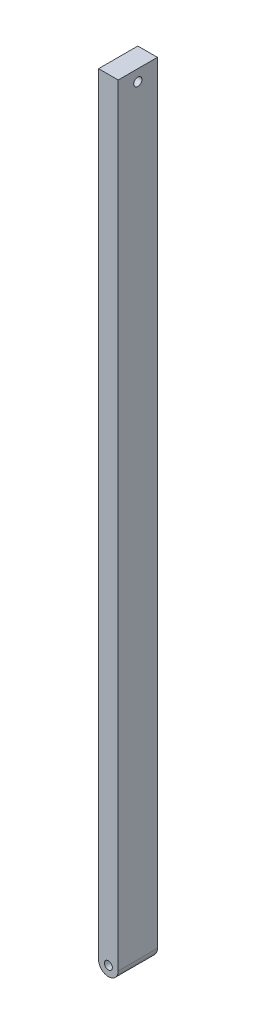
ISO-10303-21;
HEADER;
FILE_DESCRIPTION(('STEP AP214'),'2;1');
FILE_NAME('part.step','',(''),(''),'','','');
FILE_SCHEMA(('AUTOMOTIVE_DESIGN { 1 0 10303 214 1 1 1 1 }'));
ENDSEC;
DATA;
#1=APPLICATION_CONTEXT('core data for automotive mechanical design processes');
#2=APPLICATION_PROTOCOL_DEFINITION('international standard','automotive_design',2000,#1);
#3=PRODUCT_CONTEXT('',#1,'mechanical');
#4=PRODUCT('Part','Part','',(#3));
#5=PRODUCT_RELATED_PRODUCT_CATEGORY('part','',(#4));
#6=PRODUCT_DEFINITION_FORMATION('','',#4);
#7=PRODUCT_DEFINITION_CONTEXT('part definition',#1,'design');
#8=PRODUCT_DEFINITION('design','',#6,#7);
#9=PRODUCT_DEFINITION_SHAPE('','',#8);
#10=(LENGTH_UNIT() NAMED_UNIT(*) SI_UNIT(.MILLI.,.METRE.));
#11=(NAMED_UNIT(*) PLANE_ANGLE_UNIT() SI_UNIT($,.RADIAN.));
#12=(NAMED_UNIT(*) SI_UNIT($,.STERADIAN.) SOLID_ANGLE_UNIT());
#13=UNCERTAINTY_MEASURE_WITH_UNIT(LENGTH_MEASURE(1.E-05),#10,'distance_accuracy_value','');
#14=(GEOMETRIC_REPRESENTATION_CONTEXT(3) GLOBAL_UNCERTAINTY_ASSIGNED_CONTEXT((#13)) GLOBAL_UNIT_ASSIGNED_CONTEXT((#10,
#11,#12)) REPRESENTATION_CONTEXT('',''));
#15=CARTESIAN_POINT('',(0.,0.,0.));
#16=DIRECTION('',(0.,0.,1.));
#17=DIRECTION('',(1.,0.,0.));
#18=AXIS2_PLACEMENT_3D('',#15,#16,#17);
#19=CARTESIAN_POINT('',(-0.499999999999996,-40.8979953044151,2.));
#20=DIRECTION('',(0.,0.,1.));
#21=DIRECTION('',(1.,0.,0.));
#22=AXIS2_PLACEMENT_3D('',#19,#20,#21);
#23=PLANE('',#22);
#24=DIRECTION('',(0.,-1.,0.));
#25=VECTOR('',#24,1.);
#26=CARTESIAN_POINT('',(-1.,-2.1479953044151,2.));
#27=LINE('',#26,#25);
#28=CARTESIAN_POINT('',(-1.,-1.5679953044151,2.));
#29=VERTEX_POINT('',#28);
#30=CARTESIAN_POINT('',(-0.999999999999996,-40.8979953044151,2.));
#31=VERTEX_POINT('',#30);
#32=EDGE_CURVE('E77',#29,#31,#27,.T.);
#33=ORIENTED_EDGE('',*,*,#32,.T.);
#34=CARTESIAN_POINT('',(-0.499999999999996,-40.8979953044151,2.));
#35=DIRECTION('',(0.,0.,1.));
#36=DIRECTION('',(1.,0.,0.));
#37=AXIS2_PLACEMENT_3D('',#34,#35,#36);
#38=CIRCLE('',#37,0.5);
#39=CARTESIAN_POINT('',(0.,-40.8979953044151,2.));
#40=VERTEX_POINT('',#39);
#41=EDGE_CURVE('E80',#31,#40,#38,.T.);
#42=ORIENTED_EDGE('',*,*,#41,.T.);
#43=DIRECTION('',(0.,1.,0.));
#44=VECTOR('',#43,1.);
#45=CARTESIAN_POINT('',(0.,-2.1479953044151,2.));
#46=LINE('',#45,#44);
#47=CARTESIAN_POINT('',(0.,-1.5679953044151,2.));
#48=VERTEX_POINT('',#47);
#49=EDGE_CURVE('E84',#40,#48,#46,.T.);
#50=ORIENTED_EDGE('',*,*,#49,.T.);
#51=DIRECTION('',(-1.,0.,0.));
#52=VECTOR('',#51,1.);
#53=CARTESIAN_POINT('',(-1.,-1.5679953044151,2.));
#54=LINE('',#53,#52);
#55=EDGE_CURVE('E49',#48,#29,#54,.T.);
#56=ORIENTED_EDGE('',*,*,#55,.T.);
#57=EDGE_LOOP('',(#33,#42,#50,#56));
#58=FACE_BOUND('',#57,.T.);
#59=CARTESIAN_POINT('',(-0.499999999999996,-40.8979953044151,2.));
#60=DIRECTION('',(0.,0.,1.));
#61=DIRECTION('',(1.,0.,0.));
#62=AXIS2_PLACEMENT_3D('',#59,#60,#61);
#63=CIRCLE('',#62,0.20387092882995);
#64=CARTESIAN_POINT('',(-0.296129071170045,-40.8979953044151,2.));
#65=VERTEX_POINT('',#64);
#66=EDGE_CURVE('E98',#65,#65,#63,.T.);
#67=ORIENTED_EDGE('',*,*,#66,.F.);
#68=EDGE_LOOP('',(#67));
#69=FACE_BOUND('',#68,.T.);
#70=ADVANCED_FACE('F32',(#58,#69),#23,.T.);
#71=CARTESIAN_POINT('',(-0.499999999999996,-40.8979953044151,0.));
#72=DIRECTION('',(0.,0.,1.));
#73=DIRECTION('',(1.,0.,0.));
#74=AXIS2_PLACEMENT_3D('',#71,#72,#73);
#75=PLANE('',#74);
#76=DIRECTION('',(0.,-1.,0.));
#77=VECTOR('',#76,1.);
#78=CARTESIAN_POINT('',(-1.,-2.1479953044151,0.));
#79=LINE('',#78,#77);
#80=CARTESIAN_POINT('',(-1.,-1.5679953044151,0.));
#81=VERTEX_POINT('',#80);
#82=CARTESIAN_POINT('',(-0.999999999999996,-40.8979953044151,0.));
#83=VERTEX_POINT('',#82);
#84=EDGE_CURVE('E72',#81,#83,#79,.T.);
#85=ORIENTED_EDGE('',*,*,#84,.F.);
#86=DIRECTION('',(-1.,0.,0.));
#87=VECTOR('',#86,1.);
#88=CARTESIAN_POINT('',(-1.,-1.5679953044151,0.));
#89=LINE('',#88,#87);
#90=CARTESIAN_POINT('',(0.,-1.5679953044151,0.));
#91=VERTEX_POINT('',#90);
#92=EDGE_CURVE('E101',#91,#81,#89,.T.);
#93=ORIENTED_EDGE('',*,*,#92,.F.);
#94=DIRECTION('',(0.,1.,0.));
#95=VECTOR('',#94,1.);
#96=CARTESIAN_POINT('',(0.,-1.5679953044151,0.));
#97=LINE('',#96,#95);
#98=CARTESIAN_POINT('',(0.,-40.8979953044151,0.));
#99=VERTEX_POINT('',#98);
#100=EDGE_CURVE('E65',#99,#91,#97,.T.);
#101=ORIENTED_EDGE('',*,*,#100,.F.);
#102=CARTESIAN_POINT('',(-0.499999999999996,-40.8979953044151,0.));
#103=DIRECTION('',(0.,0.,1.));
#104=DIRECTION('',(1.,0.,0.));
#105=AXIS2_PLACEMENT_3D('',#102,#103,#104);
#106=CIRCLE('',#105,0.5);
#107=EDGE_CURVE('E89',#83,#99,#106,.T.);
#108=ORIENTED_EDGE('',*,*,#107,.F.);
#109=EDGE_LOOP('',(#85,#93,#101,#108));
#110=FACE_BOUND('',#109,.T.);
#111=CARTESIAN_POINT('',(-0.499999999999996,-40.8979953044151,0.));
#112=DIRECTION('',(0.,0.,1.));
#113=DIRECTION('',(1.,0.,0.));
#114=AXIS2_PLACEMENT_3D('',#111,#112,#113);
#115=CIRCLE('',#114,0.20387092882995);
#116=CARTESIAN_POINT('',(-0.296129071170045,-40.8979953044151,0.));
#117=VERTEX_POINT('',#116);
#118=EDGE_CURVE('E113',#117,#117,#115,.T.);
#119=ORIENTED_EDGE('',*,*,#118,.T.);
#120=EDGE_LOOP('',(#119));
#121=FACE_BOUND('',#120,.T.);
#122=ADVANCED_FACE('F107',(#110,#121),#75,.F.);
#123=CARTESIAN_POINT('',(-1.,-2.1479953044151,2.));
#124=DIRECTION('',(1.,0.,0.));
#125=DIRECTION('',(0.,1.,0.));
#126=AXIS2_PLACEMENT_3D('',#123,#124,#125);
#127=PLANE('',#126);
#128=CARTESIAN_POINT('',(-1.00000000000008,-2.1479953044151,1.));
#129=DIRECTION('',(1.,0.,0.));
#130=DIRECTION('',(0.,1.,0.));
#131=AXIS2_PLACEMENT_3D('',#128,#129,#130);
#132=CIRCLE('',#131,0.208826812329482);
#133=CARTESIAN_POINT('',(-1.00000000000008,-1.93916849208562,1.));
#134=VERTEX_POINT('',#133);
#135=EDGE_CURVE('E115',#134,#134,#132,.T.);
#136=ORIENTED_EDGE('',*,*,#135,.T.);
#137=EDGE_LOOP('',(#136));
#138=FACE_BOUND('',#137,.T.);
#139=ORIENTED_EDGE('',*,*,#84,.T.);
#140=DIRECTION('',(0.,0.,-1.));
#141=VECTOR('',#140,1.);
#142=CARTESIAN_POINT('',(-0.999999999999996,-40.8979953044151,2.));
#143=LINE('',#142,#141);
#144=EDGE_CURVE('E11',#31,#83,#143,.T.);
#145=ORIENTED_EDGE('',*,*,#144,.F.);
#146=ORIENTED_EDGE('',*,*,#32,.F.);
#147=DIRECTION('',(0.,0.,-1.));
#148=VECTOR('',#147,1.);
#149=CARTESIAN_POINT('',(-1.,-1.5679953044151,2.));
#150=LINE('',#149,#148);
#151=EDGE_CURVE('E93',#29,#81,#150,.T.);
#152=ORIENTED_EDGE('',*,*,#151,.T.);
#153=EDGE_LOOP('',(#139,#145,#146,#152));
#154=FACE_BOUND('',#153,.T.);
#155=ADVANCED_FACE('F34',(#138,#154),#127,.F.);
#156=CARTESIAN_POINT('',(-0.499999999999996,-40.8979953044151,2.));
#157=DIRECTION('',(0.,0.,-1.));
#158=DIRECTION('',(-1.,0.,0.));
#159=AXIS2_PLACEMENT_3D('',#156,#157,#158);
#160=CYLINDRICAL_SURFACE('',#159,0.5);
#161=ORIENTED_EDGE('',*,*,#107,.T.);
#162=DIRECTION('',(0.,0.,-1.));
#163=VECTOR('',#162,1.);
#164=CARTESIAN_POINT('',(0.,-40.8979953044151,2.));
#165=LINE('',#164,#163);
#166=EDGE_CURVE('E41',#40,#99,#165,.T.);
#167=ORIENTED_EDGE('',*,*,#166,.F.);
#168=ORIENTED_EDGE('',*,*,#41,.F.);
#169=ORIENTED_EDGE('',*,*,#144,.T.);
#170=EDGE_LOOP('',(#161,#167,#168,#169));
#171=FACE_BOUND('',#170,.T.);
#172=ADVANCED_FACE('F88',(#171),#160,.T.);
#173=CARTESIAN_POINT('',(0.,-1.5679953044151,2.));
#174=DIRECTION('',(-1.,0.,0.));
#175=DIRECTION('',(0.,-1.,0.));
#176=AXIS2_PLACEMENT_3D('',#173,#174,#175);
#177=PLANE('',#176);
#178=CARTESIAN_POINT('',(0.,-2.1479953044151,1.));
#179=DIRECTION('',(1.,0.,0.));
#180=DIRECTION('',(0.,1.,0.));
#181=AXIS2_PLACEMENT_3D('',#178,#179,#180);
#182=CIRCLE('',#181,0.208826812329482);
#183=CARTESIAN_POINT('',(0.,-1.93916849208561,1.));
#184=VERTEX_POINT('',#183);
#185=EDGE_CURVE('E120',#184,#184,#182,.T.);
#186=ORIENTED_EDGE('',*,*,#185,.F.);
#187=EDGE_LOOP('',(#186));
#188=FACE_BOUND('',#187,.T.);
#189=ORIENTED_EDGE('',*,*,#100,.T.);
#190=DIRECTION('',(0.,0.,-1.));
#191=VECTOR('',#190,1.);
#192=CARTESIAN_POINT('',(0.,-1.5679953044151,2.));
#193=LINE('',#192,#191);
#194=EDGE_CURVE('E90',#48,#91,#193,.T.);
#195=ORIENTED_EDGE('',*,*,#194,.F.);
#196=ORIENTED_EDGE('',*,*,#49,.F.);
#197=ORIENTED_EDGE('',*,*,#166,.T.);
#198=EDGE_LOOP('',(#189,#195,#196,#197));
#199=FACE_BOUND('',#198,.T.);
#200=ADVANCED_FACE('F91',(#188,#199),#177,.F.);
#201=CARTESIAN_POINT('',(-1.,-1.5679953044151,2.));
#202=DIRECTION('',(0.,-1.,0.));
#203=DIRECTION('',(0.,0.,-1.));
#204=AXIS2_PLACEMENT_3D('',#201,#202,#203);
#205=PLANE('',#204);
#206=ORIENTED_EDGE('',*,*,#92,.T.);
#207=ORIENTED_EDGE('',*,*,#151,.F.);
#208=ORIENTED_EDGE('',*,*,#55,.F.);
#209=ORIENTED_EDGE('',*,*,#194,.T.);
#210=EDGE_LOOP('',(#206,#207,#208,#209));
#211=FACE_BOUND('',#210,.T.);
#212=ADVANCED_FACE('F106',(#211),#205,.F.);
#213=CARTESIAN_POINT('',(-0.499999999999996,-40.8979953044151,2.));
#214=DIRECTION('',(0.,0.,-1.));
#215=DIRECTION('',(-1.,0.,0.));
#216=AXIS2_PLACEMENT_3D('',#213,#214,#215);
#217=CYLINDRICAL_SURFACE('',#216,0.20387092882995);
#218=ORIENTED_EDGE('',*,*,#66,.T.);
#219=EDGE_LOOP('',(#218));
#220=FACE_BOUND('',#219,.T.);
#221=ORIENTED_EDGE('',*,*,#118,.F.);
#222=EDGE_LOOP('',(#221));
#223=FACE_BOUND('',#222,.T.);
#224=ADVANCED_FACE('F134',(#220,#223),#217,.F.);
#225=CARTESIAN_POINT('',(-1.00000000000008,-2.1479953044151,1.));
#226=DIRECTION('',(1.,0.,0.));
#227=DIRECTION('',(0.,1.,0.));
#228=AXIS2_PLACEMENT_3D('',#225,#226,#227);
#229=CYLINDRICAL_SURFACE('',#228,0.208826812329482);
#230=ORIENTED_EDGE('',*,*,#135,.F.);
#231=EDGE_LOOP('',(#230));
#232=FACE_BOUND('',#231,.T.);
#233=ORIENTED_EDGE('',*,*,#185,.T.);
#234=EDGE_LOOP('',(#233));
#235=FACE_BOUND('',#234,.T.);
#236=ADVANCED_FACE('F126',(#232,#235),#229,.F.);
#237=CLOSED_SHELL('',(#70,#122,#155,#172,#200,#212,#224,#236));
#238=MANIFOLD_SOLID_BREP('B2',#237);
#239=ADVANCED_BREP_SHAPE_REPRESENTATION('',(#18,#238),#14);
#240=SHAPE_DEFINITION_REPRESENTATION(#9,#239);
ENDSEC;
END-ISO-10303-21;
